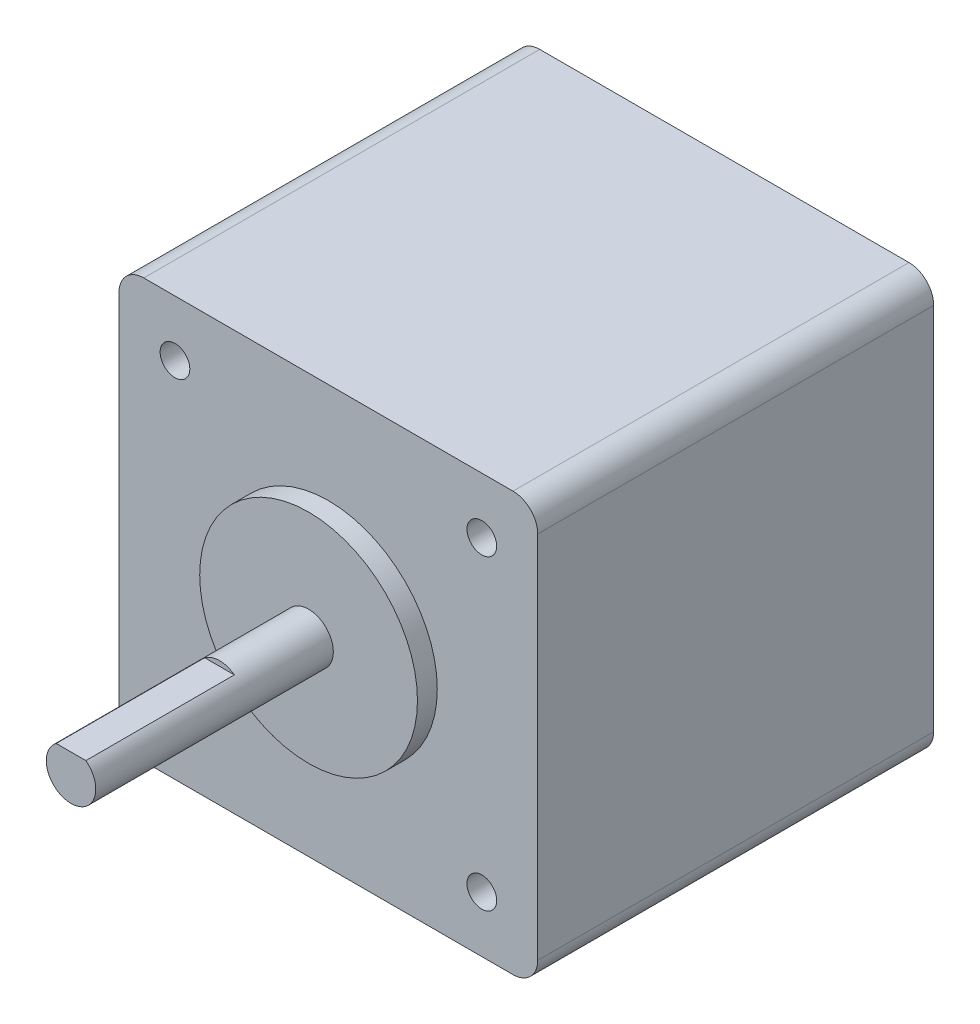
ISO-10303-21;
HEADER;
FILE_DESCRIPTION(('STEP AP214'),'2;1');
FILE_NAME('part.step','',(''),(''),'','','');
FILE_SCHEMA(('AUTOMOTIVE_DESIGN { 1 0 10303 214 1 1 1 1 }'));
ENDSEC;
DATA;
#1=APPLICATION_CONTEXT('core data for automotive mechanical design processes');
#2=APPLICATION_PROTOCOL_DEFINITION('international standard','automotive_design',2000,#1);
#3=PRODUCT_CONTEXT('',#1,'mechanical');
#4=PRODUCT('Part','Part','',(#3));
#5=PRODUCT_RELATED_PRODUCT_CATEGORY('part','',(#4));
#6=PRODUCT_DEFINITION_FORMATION('','',#4);
#7=PRODUCT_DEFINITION_CONTEXT('part definition',#1,'design');
#8=PRODUCT_DEFINITION('design','',#6,#7);
#9=PRODUCT_DEFINITION_SHAPE('','',#8);
#10=(LENGTH_UNIT() NAMED_UNIT(*) SI_UNIT(.MILLI.,.METRE.));
#11=(NAMED_UNIT(*) PLANE_ANGLE_UNIT() SI_UNIT($,.RADIAN.));
#12=(NAMED_UNIT(*) SI_UNIT($,.STERADIAN.) SOLID_ANGLE_UNIT());
#13=UNCERTAINTY_MEASURE_WITH_UNIT(LENGTH_MEASURE(1.E-05),#10,'distance_accuracy_value','');
#14=(GEOMETRIC_REPRESENTATION_CONTEXT(3) GLOBAL_UNCERTAINTY_ASSIGNED_CONTEXT((#13)) GLOBAL_UNIT_ASSIGNED_CONTEXT((#10,
#11,#12)) REPRESENTATION_CONTEXT('',''));
#15=CARTESIAN_POINT('',(0.,0.,0.));
#16=DIRECTION('',(0.,0.,1.));
#17=DIRECTION('',(1.,0.,0.));
#18=AXIS2_PLACEMENT_3D('',#15,#16,#17);
#19=CARTESIAN_POINT('',(-21.15,-21.15,40.));
#20=DIRECTION('',(1.,0.,0.));
#21=DIRECTION('',(0.,0.,-1.));
#22=AXIS2_PLACEMENT_3D('',#19,#20,#21);
#23=PLANE('',#22);
#24=DIRECTION('',(0.,-1.,0.));
#25=VECTOR('',#24,1.);
#26=CARTESIAN_POINT('',(-21.15,-21.15,0.));
#27=LINE('',#26,#25);
#28=CARTESIAN_POINT('',(-21.15,18.65,0.));
#29=VERTEX_POINT('',#28);
#30=CARTESIAN_POINT('',(-21.15,-18.65,0.));
#31=VERTEX_POINT('',#30);
#32=EDGE_CURVE('E159',#29,#31,#27,.T.);
#33=ORIENTED_EDGE('',*,*,#32,.T.);
#34=DIRECTION('',(0.,0.,-1.));
#35=VECTOR('',#34,1.);
#36=CARTESIAN_POINT('',(-21.15,-18.65,40.));
#37=LINE('',#36,#35);
#38=CARTESIAN_POINT('',(-21.15,-18.65,40.));
#39=VERTEX_POINT('',#38);
#40=EDGE_CURVE('E212',#31,#39,#37,.F.);
#41=ORIENTED_EDGE('',*,*,#40,.T.);
#42=DIRECTION('',(0.,-1.,0.));
#43=VECTOR('',#42,1.);
#44=CARTESIAN_POINT('',(-21.15,-21.15,40.));
#45=LINE('',#44,#43);
#46=CARTESIAN_POINT('',(-21.15,18.65,40.));
#47=VERTEX_POINT('',#46);
#48=EDGE_CURVE('E162',#47,#39,#45,.T.);
#49=ORIENTED_EDGE('',*,*,#48,.F.);
#50=DIRECTION('',(0.,0.,-1.));
#51=VECTOR('',#50,1.);
#52=CARTESIAN_POINT('',(-21.15,18.65,40.));
#53=LINE('',#52,#51);
#54=EDGE_CURVE('E209',#47,#29,#53,.T.);
#55=ORIENTED_EDGE('',*,*,#54,.T.);
#56=EDGE_LOOP('',(#33,#41,#49,#55));
#57=FACE_BOUND('',#56,.T.);
#58=ADVANCED_FACE('F33',(#57),#23,.F.);
#59=CARTESIAN_POINT('',(21.15,-21.15,40.));
#60=DIRECTION('',(0.,1.,0.));
#61=DIRECTION('',(-1.,0.,0.));
#62=AXIS2_PLACEMENT_3D('',#59,#60,#61);
#63=PLANE('',#62);
#64=DIRECTION('',(1.,0.,0.));
#65=VECTOR('',#64,1.);
#66=CARTESIAN_POINT('',(21.15,-21.15,0.));
#67=LINE('',#66,#65);
#68=CARTESIAN_POINT('',(-18.65,-21.15,0.));
#69=VERTEX_POINT('',#68);
#70=CARTESIAN_POINT('',(18.65,-21.15,0.));
#71=VERTEX_POINT('',#70);
#72=EDGE_CURVE('E177',#69,#71,#67,.T.);
#73=ORIENTED_EDGE('',*,*,#72,.T.);
#74=DIRECTION('',(0.,0.,-1.));
#75=VECTOR('',#74,1.);
#76=CARTESIAN_POINT('',(18.65,-21.15,40.));
#77=LINE('',#76,#75);
#78=CARTESIAN_POINT('',(18.65,-21.15,40.));
#79=VERTEX_POINT('',#78);
#80=EDGE_CURVE('E199',#71,#79,#77,.F.);
#81=ORIENTED_EDGE('',*,*,#80,.T.);
#82=DIRECTION('',(1.,0.,0.));
#83=VECTOR('',#82,1.);
#84=CARTESIAN_POINT('',(21.15,-21.15,40.));
#85=LINE('',#84,#83);
#86=CARTESIAN_POINT('',(-18.65,-21.15,40.));
#87=VERTEX_POINT('',#86);
#88=EDGE_CURVE('E165',#87,#79,#85,.T.);
#89=ORIENTED_EDGE('',*,*,#88,.F.);
#90=DIRECTION('',(0.,0.,-1.));
#91=VECTOR('',#90,1.);
#92=CARTESIAN_POINT('',(-18.65,-21.15,40.));
#93=LINE('',#92,#91);
#94=EDGE_CURVE('E196',#87,#69,#93,.T.);
#95=ORIENTED_EDGE('',*,*,#94,.T.);
#96=EDGE_LOOP('',(#73,#81,#89,#95));
#97=FACE_BOUND('',#96,.T.);
#98=ADVANCED_FACE('F240',(#97),#63,.F.);
#99=CARTESIAN_POINT('',(21.15,-21.15,40.));
#100=DIRECTION('',(-1.,0.,0.));
#101=DIRECTION('',(0.,0.,1.));
#102=AXIS2_PLACEMENT_3D('',#99,#100,#101);
#103=PLANE('',#102);
#104=DIRECTION('',(0.,1.,0.));
#105=VECTOR('',#104,1.);
#106=CARTESIAN_POINT('',(21.15,-21.15,40.));
#107=LINE('',#106,#105);
#108=CARTESIAN_POINT('',(21.15,-18.65,40.));
#109=VERTEX_POINT('',#108);
#110=CARTESIAN_POINT('',(21.15,18.65,40.));
#111=VERTEX_POINT('',#110);
#112=EDGE_CURVE('E169',#109,#111,#107,.T.);
#113=ORIENTED_EDGE('',*,*,#112,.F.);
#114=DIRECTION('',(0.,0.,-1.));
#115=VECTOR('',#114,1.);
#116=CARTESIAN_POINT('',(21.15,-18.65,40.));
#117=LINE('',#116,#115);
#118=CARTESIAN_POINT('',(21.15,-18.65,0.));
#119=VERTEX_POINT('',#118);
#120=EDGE_CURVE('E185',#109,#119,#117,.T.);
#121=ORIENTED_EDGE('',*,*,#120,.T.);
#122=DIRECTION('',(0.,1.,0.));
#123=VECTOR('',#122,1.);
#124=CARTESIAN_POINT('',(21.15,-21.15,0.));
#125=LINE('',#124,#123);
#126=CARTESIAN_POINT('',(21.15,18.65,0.));
#127=VERTEX_POINT('',#126);
#128=EDGE_CURVE('E180',#119,#127,#125,.T.);
#129=ORIENTED_EDGE('',*,*,#128,.T.);
#130=DIRECTION('',(0.,0.,-1.));
#131=VECTOR('',#130,1.);
#132=CARTESIAN_POINT('',(21.15,18.65,40.));
#133=LINE('',#132,#131);
#134=EDGE_CURVE('E174',#127,#111,#133,.F.);
#135=ORIENTED_EDGE('',*,*,#134,.T.);
#136=EDGE_LOOP('',(#113,#121,#129,#135));
#137=FACE_BOUND('',#136,.T.);
#138=ADVANCED_FACE('F248',(#137),#103,.F.);
#139=CARTESIAN_POINT('',(21.15,21.15,40.));
#140=DIRECTION('',(0.,-1.,0.));
#141=DIRECTION('',(1.,0.,0.));
#142=AXIS2_PLACEMENT_3D('',#139,#140,#141);
#143=PLANE('',#142);
#144=DIRECTION('',(-1.,0.,0.));
#145=VECTOR('',#144,1.);
#146=CARTESIAN_POINT('',(21.15,21.15,40.));
#147=LINE('',#146,#145);
#148=CARTESIAN_POINT('',(18.65,21.15,40.));
#149=VERTEX_POINT('',#148);
#150=CARTESIAN_POINT('',(-18.65,21.15,40.));
#151=VERTEX_POINT('',#150);
#152=EDGE_CURVE('E172',#149,#151,#147,.T.);
#153=ORIENTED_EDGE('',*,*,#152,.F.);
#154=DIRECTION('',(0.,0.,-1.));
#155=VECTOR('',#154,1.);
#156=CARTESIAN_POINT('',(18.65,21.15,40.));
#157=LINE('',#156,#155);
#158=CARTESIAN_POINT('',(18.65,21.15,0.));
#159=VERTEX_POINT('',#158);
#160=EDGE_CURVE('E134',#149,#159,#157,.T.);
#161=ORIENTED_EDGE('',*,*,#160,.T.);
#162=DIRECTION('',(-1.,0.,0.));
#163=VECTOR('',#162,1.);
#164=CARTESIAN_POINT('',(21.15,21.15,0.));
#165=LINE('',#164,#163);
#166=CARTESIAN_POINT('',(-18.65,21.15,0.));
#167=VERTEX_POINT('',#166);
#168=EDGE_CURVE('E166',#159,#167,#165,.T.);
#169=ORIENTED_EDGE('',*,*,#168,.T.);
#170=DIRECTION('',(0.,0.,-1.));
#171=VECTOR('',#170,1.);
#172=CARTESIAN_POINT('',(-18.65,21.15,40.));
#173=LINE('',#172,#171);
#174=EDGE_CURVE('E56',#167,#151,#173,.F.);
#175=ORIENTED_EDGE('',*,*,#174,.T.);
#176=EDGE_LOOP('',(#153,#161,#169,#175));
#177=FACE_BOUND('',#176,.T.);
#178=ADVANCED_FACE('F218',(#177),#143,.F.);
#179=CARTESIAN_POINT('',(0.,0.,40.));
#180=DIRECTION('',(0.,0.,1.));
#181=DIRECTION('',(1.,0.,0.));
#182=AXIS2_PLACEMENT_3D('',#179,#180,#181);
#183=PLANE('',#182);
#184=CARTESIAN_POINT('',(0.,0.,40.));
#185=DIRECTION('',(0.,0.,1.));
#186=DIRECTION('',(1.,0.,0.));
#187=AXIS2_PLACEMENT_3D('',#184,#185,#186);
#188=CIRCLE('',#187,11.);
#189=CARTESIAN_POINT('',(11.,0.,40.));
#190=VERTEX_POINT('',#189);
#191=EDGE_CURVE('E125',#190,#190,#188,.T.);
#192=ORIENTED_EDGE('',*,*,#191,.F.);
#193=EDGE_LOOP('',(#192));
#194=FACE_BOUND('',#193,.T.);
#195=CARTESIAN_POINT('',(-15.4999999999987,-15.5,40.));
#196=DIRECTION('',(0.,0.,1.));
#197=DIRECTION('',(1.,0.,0.));
#198=AXIS2_PLACEMENT_3D('',#195,#196,#197);
#199=CIRCLE('',#198,1.5);
#200=CARTESIAN_POINT('',(-13.9999999999987,-15.5,40.));
#201=VERTEX_POINT('',#200);
#202=EDGE_CURVE('E136',#201,#201,#199,.T.);
#203=ORIENTED_EDGE('',*,*,#202,.F.);
#204=EDGE_LOOP('',(#203));
#205=FACE_BOUND('',#204,.T.);
#206=CARTESIAN_POINT('',(15.5000000000013,-15.4999999999987,40.));
#207=DIRECTION('',(0.,0.,1.));
#208=DIRECTION('',(1.,0.,0.));
#209=AXIS2_PLACEMENT_3D('',#206,#207,#208);
#210=CIRCLE('',#209,1.5);
#211=CARTESIAN_POINT('',(17.0000000000013,-15.4999999999987,40.));
#212=VERTEX_POINT('',#211);
#213=EDGE_CURVE('E148',#212,#212,#210,.T.);
#214=ORIENTED_EDGE('',*,*,#213,.F.);
#215=EDGE_LOOP('',(#214));
#216=FACE_BOUND('',#215,.T.);
#217=CARTESIAN_POINT('',(15.5,15.5000000000013,40.));
#218=DIRECTION('',(0.,0.,1.));
#219=DIRECTION('',(1.,0.,0.));
#220=AXIS2_PLACEMENT_3D('',#217,#218,#219);
#221=CIRCLE('',#220,1.5);
#222=CARTESIAN_POINT('',(17.,15.5000000000013,40.));
#223=VERTEX_POINT('',#222);
#224=EDGE_CURVE('E142',#223,#223,#221,.T.);
#225=ORIENTED_EDGE('',*,*,#224,.F.);
#226=EDGE_LOOP('',(#225));
#227=FACE_BOUND('',#226,.T.);
#228=CARTESIAN_POINT('',(-15.5,15.5,40.));
#229=DIRECTION('',(0.,0.,1.));
#230=DIRECTION('',(1.,0.,0.));
#231=AXIS2_PLACEMENT_3D('',#228,#229,#230);
#232=CIRCLE('',#231,1.5);
#233=CARTESIAN_POINT('',(-14.,15.5,40.));
#234=VERTEX_POINT('',#233);
#235=EDGE_CURVE('E141',#234,#234,#232,.T.);
#236=ORIENTED_EDGE('',*,*,#235,.F.);
#237=EDGE_LOOP('',(#236));
#238=FACE_BOUND('',#237,.T.);
#239=ORIENTED_EDGE('',*,*,#88,.T.);
#240=CARTESIAN_POINT('',(18.65,-18.65,40.));
#241=DIRECTION('',(0.,0.,1.));
#242=DIRECTION('',(1.,0.,0.));
#243=AXIS2_PLACEMENT_3D('',#240,#241,#242);
#244=CIRCLE('',#243,2.5);
#245=EDGE_CURVE('E207',#79,#109,#244,.T.);
#246=ORIENTED_EDGE('',*,*,#245,.T.);
#247=ORIENTED_EDGE('',*,*,#112,.T.);
#248=CARTESIAN_POINT('',(18.65,18.65,40.));
#249=DIRECTION('',(0.,0.,1.));
#250=DIRECTION('',(1.,0.,0.));
#251=AXIS2_PLACEMENT_3D('',#248,#249,#250);
#252=CIRCLE('',#251,2.5);
#253=EDGE_CURVE('E203',#111,#149,#252,.T.);
#254=ORIENTED_EDGE('',*,*,#253,.T.);
#255=ORIENTED_EDGE('',*,*,#152,.T.);
#256=CARTESIAN_POINT('',(-18.65,18.65,40.));
#257=DIRECTION('',(0.,0.,1.));
#258=DIRECTION('',(1.,0.,0.));
#259=AXIS2_PLACEMENT_3D('',#256,#257,#258);
#260=CIRCLE('',#259,2.5);
#261=EDGE_CURVE('E201',#151,#47,#260,.T.);
#262=ORIENTED_EDGE('',*,*,#261,.T.);
#263=ORIENTED_EDGE('',*,*,#48,.T.);
#264=CARTESIAN_POINT('',(-18.65,-18.65,40.));
#265=DIRECTION('',(0.,0.,1.));
#266=DIRECTION('',(1.,0.,0.));
#267=AXIS2_PLACEMENT_3D('',#264,#265,#266);
#268=CIRCLE('',#267,2.5);
#269=EDGE_CURVE('E205',#39,#87,#268,.T.);
#270=ORIENTED_EDGE('',*,*,#269,.T.);
#271=EDGE_LOOP('',(#239,#246,#247,#254,#255,#262,#263,#270));
#272=FACE_BOUND('',#271,.T.);
#273=ADVANCED_FACE('F233',(#194,#205,#216,#227,#238,#272),#183,.T.);
#274=CARTESIAN_POINT('',(0.,0.,0.));
#275=DIRECTION('',(0.,0.,1.));
#276=DIRECTION('',(1.,0.,0.));
#277=AXIS2_PLACEMENT_3D('',#274,#275,#276);
#278=PLANE('',#277);
#279=ORIENTED_EDGE('',*,*,#128,.F.);
#280=CARTESIAN_POINT('',(18.65,-18.65,0.));
#281=DIRECTION('',(0.,0.,1.));
#282=DIRECTION('',(1.,0.,0.));
#283=AXIS2_PLACEMENT_3D('',#280,#281,#282);
#284=CIRCLE('',#283,2.5);
#285=EDGE_CURVE('E194',#119,#71,#284,.F.);
#286=ORIENTED_EDGE('',*,*,#285,.T.);
#287=ORIENTED_EDGE('',*,*,#72,.F.);
#288=CARTESIAN_POINT('',(-18.65,-18.65,0.));
#289=DIRECTION('',(0.,0.,1.));
#290=DIRECTION('',(1.,0.,0.));
#291=AXIS2_PLACEMENT_3D('',#288,#289,#290);
#292=CIRCLE('',#291,2.5);
#293=EDGE_CURVE('E192',#69,#31,#292,.F.);
#294=ORIENTED_EDGE('',*,*,#293,.T.);
#295=ORIENTED_EDGE('',*,*,#32,.F.);
#296=CARTESIAN_POINT('',(-18.65,18.65,0.));
#297=DIRECTION('',(0.,0.,1.));
#298=DIRECTION('',(1.,0.,0.));
#299=AXIS2_PLACEMENT_3D('',#296,#297,#298);
#300=CIRCLE('',#299,2.5);
#301=EDGE_CURVE('E188',#29,#167,#300,.F.);
#302=ORIENTED_EDGE('',*,*,#301,.T.);
#303=ORIENTED_EDGE('',*,*,#168,.F.);
#304=CARTESIAN_POINT('',(18.65,18.65,0.));
#305=DIRECTION('',(0.,0.,1.));
#306=DIRECTION('',(1.,0.,0.));
#307=AXIS2_PLACEMENT_3D('',#304,#305,#306);
#308=CIRCLE('',#307,2.5);
#309=EDGE_CURVE('E190',#159,#127,#308,.F.);
#310=ORIENTED_EDGE('',*,*,#309,.T.);
#311=EDGE_LOOP('',(#279,#286,#287,#294,#295,#302,#303,#310));
#312=FACE_BOUND('',#311,.T.);
#313=ADVANCED_FACE('F223',(#312),#278,.F.);
#314=CARTESIAN_POINT('',(18.65,-18.65,40.));
#315=DIRECTION('',(0.,0.,-1.));
#316=DIRECTION('',(-1.,0.,0.));
#317=AXIS2_PLACEMENT_3D('',#314,#315,#316);
#318=CYLINDRICAL_SURFACE('',#317,2.5);
#319=ORIENTED_EDGE('',*,*,#245,.F.);
#320=ORIENTED_EDGE('',*,*,#80,.F.);
#321=ORIENTED_EDGE('',*,*,#285,.F.);
#322=ORIENTED_EDGE('',*,*,#120,.F.);
#323=EDGE_LOOP('',(#319,#320,#321,#322));
#324=FACE_BOUND('',#323,.T.);
#325=ADVANCED_FACE('F245',(#324),#318,.T.);
#326=CARTESIAN_POINT('',(-18.65,-18.65,40.));
#327=DIRECTION('',(0.,0.,-1.));
#328=DIRECTION('',(-1.,0.,0.));
#329=AXIS2_PLACEMENT_3D('',#326,#327,#328);
#330=CYLINDRICAL_SURFACE('',#329,2.5);
#331=ORIENTED_EDGE('',*,*,#269,.F.);
#332=ORIENTED_EDGE('',*,*,#40,.F.);
#333=ORIENTED_EDGE('',*,*,#293,.F.);
#334=ORIENTED_EDGE('',*,*,#94,.F.);
#335=EDGE_LOOP('',(#331,#332,#333,#334));
#336=FACE_BOUND('',#335,.T.);
#337=ADVANCED_FACE('F237',(#336),#330,.T.);
#338=CARTESIAN_POINT('',(18.65,18.65,40.));
#339=DIRECTION('',(0.,0.,-1.));
#340=DIRECTION('',(-1.,0.,0.));
#341=AXIS2_PLACEMENT_3D('',#338,#339,#340);
#342=CYLINDRICAL_SURFACE('',#341,2.5);
#343=ORIENTED_EDGE('',*,*,#253,.F.);
#344=ORIENTED_EDGE('',*,*,#134,.F.);
#345=ORIENTED_EDGE('',*,*,#309,.F.);
#346=ORIENTED_EDGE('',*,*,#160,.F.);
#347=EDGE_LOOP('',(#343,#344,#345,#346));
#348=FACE_BOUND('',#347,.T.);
#349=ADVANCED_FACE('F250',(#348),#342,.T.);
#350=CARTESIAN_POINT('',(-18.65,18.65,40.));
#351=DIRECTION('',(0.,0.,-1.));
#352=DIRECTION('',(-1.,0.,0.));
#353=AXIS2_PLACEMENT_3D('',#350,#351,#352);
#354=CYLINDRICAL_SURFACE('',#353,2.5);
#355=ORIENTED_EDGE('',*,*,#261,.F.);
#356=ORIENTED_EDGE('',*,*,#174,.F.);
#357=ORIENTED_EDGE('',*,*,#301,.F.);
#358=ORIENTED_EDGE('',*,*,#54,.F.);
#359=EDGE_LOOP('',(#355,#356,#357,#358));
#360=FACE_BOUND('',#359,.T.);
#361=ADVANCED_FACE('F35',(#360),#354,.T.);
#362=CARTESIAN_POINT('',(-15.5,15.5,35.5));
#363=DIRECTION('',(0.,0.,1.));
#364=DIRECTION('',(1.,0.,0.));
#365=AXIS2_PLACEMENT_3D('',#362,#363,#364);
#366=CYLINDRICAL_SURFACE('',#365,1.5);
#367=CARTESIAN_POINT('',(-15.5,15.5,35.5));
#368=DIRECTION('',(0.,0.,1.));
#369=DIRECTION('',(1.,0.,0.));
#370=AXIS2_PLACEMENT_3D('',#367,#368,#369);
#371=CIRCLE('',#370,1.5);
#372=CARTESIAN_POINT('',(-14.,15.5,35.5));
#373=VERTEX_POINT('',#372);
#374=EDGE_CURVE('E156',#373,#373,#371,.T.);
#375=ORIENTED_EDGE('',*,*,#374,.F.);
#376=EDGE_LOOP('',(#375));
#377=FACE_BOUND('',#376,.T.);
#378=ORIENTED_EDGE('',*,*,#235,.T.);
#379=EDGE_LOOP('',(#378));
#380=FACE_BOUND('',#379,.T.);
#381=ADVANCED_FACE('F256',(#377,#380),#366,.F.);
#382=CARTESIAN_POINT('',(-15.5,15.5,35.5));
#383=DIRECTION('',(0.,0.,1.));
#384=DIRECTION('',(1.,0.,0.));
#385=AXIS2_PLACEMENT_3D('',#382,#383,#384);
#386=PLANE('',#385);
#387=ORIENTED_EDGE('',*,*,#374,.T.);
#388=EDGE_LOOP('',(#387));
#389=FACE_BOUND('',#388,.T.);
#390=ADVANCED_FACE('F366',(#389),#386,.T.);
#391=CARTESIAN_POINT('',(15.5,15.5000000000013,35.5));
#392=DIRECTION('',(0.,0.,1.));
#393=DIRECTION('',(1.,0.,0.));
#394=AXIS2_PLACEMENT_3D('',#391,#392,#393);
#395=CYLINDRICAL_SURFACE('',#394,1.5);
#396=CARTESIAN_POINT('',(15.5,15.5000000000013,35.5));
#397=DIRECTION('',(0.,0.,1.));
#398=DIRECTION('',(1.,0.,0.));
#399=AXIS2_PLACEMENT_3D('',#396,#397,#398);
#400=CIRCLE('',#399,1.5);
#401=CARTESIAN_POINT('',(17.,15.5000000000013,35.5));
#402=VERTEX_POINT('',#401);
#403=EDGE_CURVE('E138',#402,#402,#400,.T.);
#404=ORIENTED_EDGE('',*,*,#403,.F.);
#405=EDGE_LOOP('',(#404));
#406=FACE_BOUND('',#405,.T.);
#407=ORIENTED_EDGE('',*,*,#224,.T.);
#408=EDGE_LOOP('',(#407));
#409=FACE_BOUND('',#408,.T.);
#410=ADVANCED_FACE('F362',(#406,#409),#395,.F.);
#411=CARTESIAN_POINT('',(15.5,15.5000000000013,35.5));
#412=DIRECTION('',(0.,0.,1.));
#413=DIRECTION('',(1.,0.,0.));
#414=AXIS2_PLACEMENT_3D('',#411,#412,#413);
#415=PLANE('',#414);
#416=ORIENTED_EDGE('',*,*,#403,.T.);
#417=EDGE_LOOP('',(#416));
#418=FACE_BOUND('',#417,.T.);
#419=ADVANCED_FACE('F358',(#418),#415,.T.);
#420=CARTESIAN_POINT('',(15.5000000000013,-15.4999999999987,35.5));
#421=DIRECTION('',(0.,0.,1.));
#422=DIRECTION('',(1.,0.,0.));
#423=AXIS2_PLACEMENT_3D('',#420,#421,#422);
#424=CYLINDRICAL_SURFACE('',#423,1.5);
#425=CARTESIAN_POINT('',(15.5000000000013,-15.4999999999987,35.5));
#426=DIRECTION('',(0.,0.,1.));
#427=DIRECTION('',(1.,0.,0.));
#428=AXIS2_PLACEMENT_3D('',#425,#426,#427);
#429=CIRCLE('',#428,1.5);
#430=CARTESIAN_POINT('',(17.0000000000013,-15.4999999999987,35.5));
#431=VERTEX_POINT('',#430);
#432=EDGE_CURVE('E145',#431,#431,#429,.T.);
#433=ORIENTED_EDGE('',*,*,#432,.F.);
#434=EDGE_LOOP('',(#433));
#435=FACE_BOUND('',#434,.T.);
#436=ORIENTED_EDGE('',*,*,#213,.T.);
#437=EDGE_LOOP('',(#436));
#438=FACE_BOUND('',#437,.T.);
#439=ADVANCED_FACE('F361',(#435,#438),#424,.F.);
#440=CARTESIAN_POINT('',(15.5000000000013,-15.4999999999987,35.5));
#441=DIRECTION('',(0.,0.,1.));
#442=DIRECTION('',(1.,0.,0.));
#443=AXIS2_PLACEMENT_3D('',#440,#441,#442);
#444=PLANE('',#443);
#445=ORIENTED_EDGE('',*,*,#432,.T.);
#446=EDGE_LOOP('',(#445));
#447=FACE_BOUND('',#446,.T.);
#448=ADVANCED_FACE('F368',(#447),#444,.T.);
#449=CARTESIAN_POINT('',(-15.4999999999987,-15.5,35.5));
#450=DIRECTION('',(0.,0.,1.));
#451=DIRECTION('',(1.,0.,0.));
#452=AXIS2_PLACEMENT_3D('',#449,#450,#451);
#453=CYLINDRICAL_SURFACE('',#452,1.5);
#454=CARTESIAN_POINT('',(-15.4999999999987,-15.5,35.5));
#455=DIRECTION('',(0.,0.,1.));
#456=DIRECTION('',(1.,0.,0.));
#457=AXIS2_PLACEMENT_3D('',#454,#455,#456);
#458=CIRCLE('',#457,1.5);
#459=CARTESIAN_POINT('',(-13.9999999999987,-15.5,35.5));
#460=VERTEX_POINT('',#459);
#461=EDGE_CURVE('E151',#460,#460,#458,.T.);
#462=ORIENTED_EDGE('',*,*,#461,.F.);
#463=EDGE_LOOP('',(#462));
#464=FACE_BOUND('',#463,.T.);
#465=ORIENTED_EDGE('',*,*,#202,.T.);
#466=EDGE_LOOP('',(#465));
#467=FACE_BOUND('',#466,.T.);
#468=ADVANCED_FACE('F371',(#464,#467),#453,.F.);
#469=CARTESIAN_POINT('',(-15.4999999999987,-15.5,35.5));
#470=DIRECTION('',(0.,0.,1.));
#471=DIRECTION('',(1.,0.,0.));
#472=AXIS2_PLACEMENT_3D('',#469,#470,#471);
#473=PLANE('',#472);
#474=ORIENTED_EDGE('',*,*,#461,.T.);
#475=EDGE_LOOP('',(#474));
#476=FACE_BOUND('',#475,.T.);
#477=ADVANCED_FACE('F299',(#476),#473,.T.);
#478=CARTESIAN_POINT('',(0.,0.,42.));
#479=DIRECTION('',(0.,0.,-1.));
#480=DIRECTION('',(-1.,0.,0.));
#481=AXIS2_PLACEMENT_3D('',#478,#479,#480);
#482=CYLINDRICAL_SURFACE('',#481,11.);
#483=CARTESIAN_POINT('',(0.,0.,42.));
#484=DIRECTION('',(0.,0.,1.));
#485=DIRECTION('',(1.,0.,0.));
#486=AXIS2_PLACEMENT_3D('',#483,#484,#485);
#487=CIRCLE('',#486,11.);
#488=CARTESIAN_POINT('',(11.,0.,42.));
#489=VERTEX_POINT('',#488);
#490=EDGE_CURVE('E128',#489,#489,#487,.T.);
#491=ORIENTED_EDGE('',*,*,#490,.F.);
#492=EDGE_LOOP('',(#491));
#493=FACE_BOUND('',#492,.T.);
#494=ORIENTED_EDGE('',*,*,#191,.T.);
#495=EDGE_LOOP('',(#494));
#496=FACE_BOUND('',#495,.T.);
#497=ADVANCED_FACE('F304',(#493,#496),#482,.T.);
#498=CARTESIAN_POINT('',(0.,0.,42.));
#499=DIRECTION('',(0.,0.,1.));
#500=DIRECTION('',(1.,0.,0.));
#501=AXIS2_PLACEMENT_3D('',#498,#499,#500);
#502=PLANE('',#501);
#503=CARTESIAN_POINT('',(0.,0.,42.));
#504=DIRECTION('',(0.,0.,1.));
#505=DIRECTION('',(1.,0.,0.));
#506=AXIS2_PLACEMENT_3D('',#503,#504,#505);
#507=CIRCLE('',#506,2.5);
#508=CARTESIAN_POINT('',(2.5,0.,42.));
#509=VERTEX_POINT('',#508);
#510=EDGE_CURVE('E116',#509,#509,#507,.T.);
#511=ORIENTED_EDGE('',*,*,#510,.F.);
#512=EDGE_LOOP('',(#511));
#513=FACE_BOUND('',#512,.T.);
#514=ORIENTED_EDGE('',*,*,#490,.T.);
#515=EDGE_LOOP('',(#514));
#516=FACE_BOUND('',#515,.T.);
#517=ADVANCED_FACE('F309',(#513,#516),#502,.T.);
#518=CARTESIAN_POINT('',(0.,0.,66.));
#519=DIRECTION('',(0.,0.,-1.));
#520=DIRECTION('',(-1.,0.,0.));
#521=AXIS2_PLACEMENT_3D('',#518,#519,#520);
#522=CYLINDRICAL_SURFACE('',#521,2.5);
#523=CARTESIAN_POINT('',(0.,0.,66.));
#524=DIRECTION('',(0.,0.,1.));
#525=DIRECTION('',(1.,0.,0.));
#526=AXIS2_PLACEMENT_3D('',#523,#524,#525);
#527=CIRCLE('',#526,2.5);
#528=CARTESIAN_POINT('',(-1.5,2.,66.));
#529=VERTEX_POINT('',#528);
#530=CARTESIAN_POINT('',(1.5,2.,66.));
#531=VERTEX_POINT('',#530);
#532=EDGE_CURVE('E121',#529,#531,#527,.T.);
#533=ORIENTED_EDGE('',*,*,#532,.F.);
#534=DIRECTION('',(0.,0.,-1.));
#535=VECTOR('',#534,1.);
#536=CARTESIAN_POINT('',(-1.5,2.,66.));
#537=LINE('',#536,#535);
#538=CARTESIAN_POINT('',(-1.5,2.,51.));
#539=VERTEX_POINT('',#538);
#540=EDGE_CURVE('E48',#529,#539,#537,.T.);
#541=ORIENTED_EDGE('',*,*,#540,.T.);
#542=CARTESIAN_POINT('',(0.,0.,51.));
#543=DIRECTION('',(0.,0.,1.));
#544=DIRECTION('',(1.,0.,0.));
#545=AXIS2_PLACEMENT_3D('',#542,#543,#544);
#546=CIRCLE('',#545,2.5);
#547=CARTESIAN_POINT('',(1.5,2.,51.));
#548=VERTEX_POINT('',#547);
#549=EDGE_CURVE('E11',#548,#539,#546,.T.);
#550=ORIENTED_EDGE('',*,*,#549,.F.);
#551=DIRECTION('',(0.,0.,-1.));
#552=VECTOR('',#551,1.);
#553=CARTESIAN_POINT('',(1.5,2.,66.));
#554=LINE('',#553,#552);
#555=EDGE_CURVE('E111',#548,#531,#554,.F.);
#556=ORIENTED_EDGE('',*,*,#555,.T.);
#557=EDGE_LOOP('',(#533,#541,#550,#556));
#558=FACE_BOUND('',#557,.T.);
#559=ORIENTED_EDGE('',*,*,#510,.T.);
#560=EDGE_LOOP('',(#559));
#561=FACE_BOUND('',#560,.T.);
#562=ADVANCED_FACE('F119',(#558,#561),#522,.T.);
#563=CARTESIAN_POINT('',(0.,0.,66.));
#564=DIRECTION('',(0.,0.,1.));
#565=DIRECTION('',(1.,0.,0.));
#566=AXIS2_PLACEMENT_3D('',#563,#564,#565);
#567=PLANE('',#566);
#568=DIRECTION('',(1.,0.,0.));
#569=VECTOR('',#568,1.);
#570=CARTESIAN_POINT('',(0.,2.,66.));
#571=LINE('',#570,#569);
#572=EDGE_CURVE('E41',#529,#531,#571,.T.);
#573=ORIENTED_EDGE('',*,*,#572,.F.);
#574=ORIENTED_EDGE('',*,*,#532,.T.);
#575=EDGE_LOOP('',(#573,#574));
#576=FACE_BOUND('',#575,.T.);
#577=ADVANCED_FACE('F124',(#576),#567,.T.);
#578=CARTESIAN_POINT('',(0.,0.,51.));
#579=DIRECTION('',(0.,0.,1.));
#580=DIRECTION('',(1.,0.,0.));
#581=AXIS2_PLACEMENT_3D('',#578,#579,#580);
#582=PLANE('',#581);
#583=ORIENTED_EDGE('',*,*,#549,.T.);
#584=DIRECTION('',(1.,0.,0.));
#585=VECTOR('',#584,1.);
#586=CARTESIAN_POINT('',(4.,2.,51.));
#587=LINE('',#586,#585);
#588=EDGE_CURVE('E122',#539,#548,#587,.T.);
#589=ORIENTED_EDGE('',*,*,#588,.T.);
#590=EDGE_LOOP('',(#583,#589));
#591=FACE_BOUND('',#590,.T.);
#592=ADVANCED_FACE('F336',(#591),#582,.T.);
#593=CARTESIAN_POINT('',(4.,2.,51.));
#594=DIRECTION('',(0.,-1.,0.));
#595=DIRECTION('',(1.,0.,0.));
#596=AXIS2_PLACEMENT_3D('',#593,#594,#595);
#597=PLANE('',#596);
#598=ORIENTED_EDGE('',*,*,#572,.T.);
#599=ORIENTED_EDGE('',*,*,#555,.F.);
#600=ORIENTED_EDGE('',*,*,#588,.F.);
#601=ORIENTED_EDGE('',*,*,#540,.F.);
#602=EDGE_LOOP('',(#598,#599,#600,#601));
#603=FACE_BOUND('',#602,.T.);
#604=ADVANCED_FACE('F110',(#603),#597,.F.);
#605=CLOSED_SHELL('',(#58,#98,#138,#178,#273,#313,#325,#337,#349,#361,#381,#390,#410,#419,#439,
#448,#468,#477,#497,#517,#562,#577,#592,#604));
#606=MANIFOLD_SOLID_BREP('B2',#605);
#607=ADVANCED_BREP_SHAPE_REPRESENTATION('',(#18,#606),#14);
#608=SHAPE_DEFINITION_REPRESENTATION(#9,#607);
ENDSEC;
END-ISO-10303-21;
